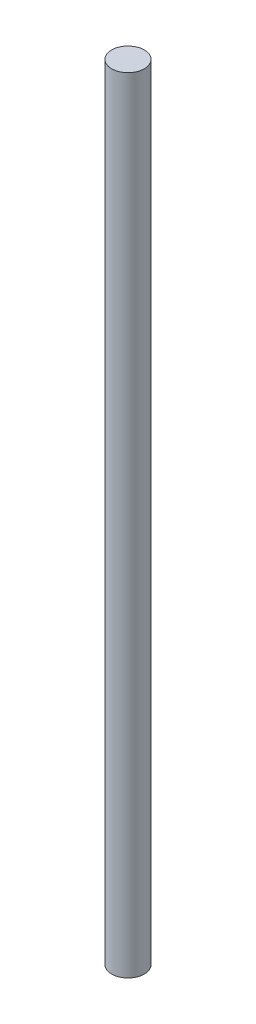
ISO-10303-21;
HEADER;
FILE_DESCRIPTION(('STEP AP214'),'2;1');
FILE_NAME('part.step','',(''),(''),'','','');
FILE_SCHEMA(('AUTOMOTIVE_DESIGN { 1 0 10303 214 1 1 1 1 }'));
ENDSEC;
DATA;
#1=APPLICATION_CONTEXT('core data for automotive mechanical design processes');
#2=APPLICATION_PROTOCOL_DEFINITION('international standard','automotive_design',2000,#1);
#3=PRODUCT_CONTEXT('',#1,'mechanical');
#4=PRODUCT('Part','Part','',(#3));
#5=PRODUCT_RELATED_PRODUCT_CATEGORY('part','',(#4));
#6=PRODUCT_DEFINITION_FORMATION('','',#4);
#7=PRODUCT_DEFINITION_CONTEXT('part definition',#1,'design');
#8=PRODUCT_DEFINITION('design','',#6,#7);
#9=PRODUCT_DEFINITION_SHAPE('','',#8);
#10=(LENGTH_UNIT() NAMED_UNIT(*) SI_UNIT(.MILLI.,.METRE.));
#11=(NAMED_UNIT(*) PLANE_ANGLE_UNIT() SI_UNIT($,.RADIAN.));
#12=(NAMED_UNIT(*) SI_UNIT($,.STERADIAN.) SOLID_ANGLE_UNIT());
#13=UNCERTAINTY_MEASURE_WITH_UNIT(LENGTH_MEASURE(1.E-05),#10,'distance_accuracy_value','');
#14=(GEOMETRIC_REPRESENTATION_CONTEXT(3) GLOBAL_UNCERTAINTY_ASSIGNED_CONTEXT((#13)) GLOBAL_UNIT_ASSIGNED_CONTEXT((#10,
#11,#12)) REPRESENTATION_CONTEXT('',''));
#15=CARTESIAN_POINT('',(0.,0.,0.));
#16=DIRECTION('',(0.,0.,1.));
#17=DIRECTION('',(1.,0.,0.));
#18=AXIS2_PLACEMENT_3D('',#15,#16,#17);
#19=CARTESIAN_POINT('',(0.,609.6,0.));
#20=DIRECTION('',(0.,-1.,0.));
#21=DIRECTION('',(0.,0.,-1.));
#22=AXIS2_PLACEMENT_3D('',#19,#20,#21);
#23=CYLINDRICAL_SURFACE('',#22,12.7);
#24=CARTESIAN_POINT('',(0.,609.6,0.));
#25=DIRECTION('',(0.,1.,0.));
#26=DIRECTION('',(0.,0.,1.));
#27=AXIS2_PLACEMENT_3D('',#24,#25,#26);
#28=CIRCLE('',#27,12.7);
#29=CARTESIAN_POINT('',(0.,609.6,12.7));
#30=VERTEX_POINT('',#29);
#31=EDGE_CURVE('E10',#30,#30,#28,.T.);
#32=ORIENTED_EDGE('',*,*,#31,.F.);
#33=EDGE_LOOP('',(#32));
#34=FACE_BOUND('',#33,.T.);
#35=CARTESIAN_POINT('',(0.,0.,0.));
#36=DIRECTION('',(0.,1.,0.));
#37=DIRECTION('',(0.,0.,1.));
#38=AXIS2_PLACEMENT_3D('',#35,#36,#37);
#39=CIRCLE('',#38,12.7);
#40=CARTESIAN_POINT('',(0.,0.,12.7));
#41=VERTEX_POINT('',#40);
#42=EDGE_CURVE('E34',#41,#41,#39,.T.);
#43=ORIENTED_EDGE('',*,*,#42,.T.);
#44=EDGE_LOOP('',(#43));
#45=FACE_BOUND('',#44,.T.);
#46=ADVANCED_FACE('F31',(#34,#45),#23,.T.);
#47=CARTESIAN_POINT('',(0.,609.6,0.));
#48=DIRECTION('',(0.,1.,0.));
#49=DIRECTION('',(0.,0.,1.));
#50=AXIS2_PLACEMENT_3D('',#47,#48,#49);
#51=PLANE('',#50);
#52=ORIENTED_EDGE('',*,*,#31,.T.);
#53=EDGE_LOOP('',(#52));
#54=FACE_BOUND('',#53,.T.);
#55=ADVANCED_FACE('F46',(#54),#51,.T.);
#56=CARTESIAN_POINT('',(0.,0.,0.));
#57=DIRECTION('',(0.,1.,0.));
#58=DIRECTION('',(0.,0.,1.));
#59=AXIS2_PLACEMENT_3D('',#56,#57,#58);
#60=PLANE('',#59);
#61=ORIENTED_EDGE('',*,*,#42,.F.);
#62=EDGE_LOOP('',(#61));
#63=FACE_BOUND('',#62,.T.);
#64=ADVANCED_FACE('F44',(#63),#60,.F.);
#65=CLOSED_SHELL('',(#46,#55,#64));
#66=MANIFOLD_SOLID_BREP('B2',#65);
#67=ADVANCED_BREP_SHAPE_REPRESENTATION('',(#18,#66),#14);
#68=SHAPE_DEFINITION_REPRESENTATION(#9,#67);
ENDSEC;
END-ISO-10303-21;
